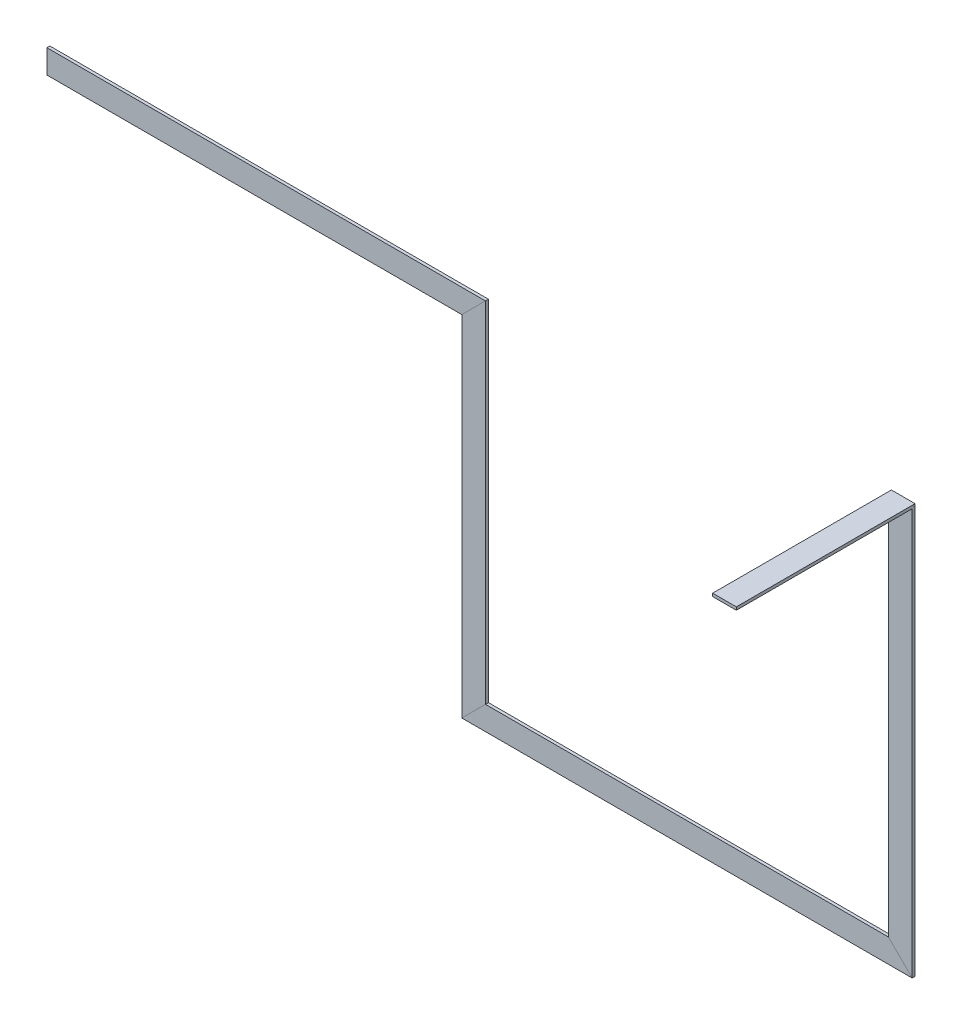
ISO-10303-21;
HEADER;
FILE_DESCRIPTION(('STEP AP214'),'2;1');
FILE_NAME('part.step','',(''),(''),'','','');
FILE_SCHEMA(('AUTOMOTIVE_DESIGN { 1 0 10303 214 1 1 1 1 }'));
ENDSEC;
DATA;
#1=APPLICATION_CONTEXT('core data for automotive mechanical design processes');
#2=APPLICATION_PROTOCOL_DEFINITION('international standard','automotive_design',2000,#1);
#3=PRODUCT_CONTEXT('',#1,'mechanical');
#4=PRODUCT('Part','Part','',(#3));
#5=PRODUCT_RELATED_PRODUCT_CATEGORY('part','',(#4));
#6=PRODUCT_DEFINITION_FORMATION('','',#4);
#7=PRODUCT_DEFINITION_CONTEXT('part definition',#1,'design');
#8=PRODUCT_DEFINITION('design','',#6,#7);
#9=PRODUCT_DEFINITION_SHAPE('','',#8);
#10=(LENGTH_UNIT() NAMED_UNIT(*) SI_UNIT(.MILLI.,.METRE.));
#11=(NAMED_UNIT(*) PLANE_ANGLE_UNIT() SI_UNIT($,.RADIAN.));
#12=(NAMED_UNIT(*) SI_UNIT($,.STERADIAN.) SOLID_ANGLE_UNIT());
#13=UNCERTAINTY_MEASURE_WITH_UNIT(LENGTH_MEASURE(1.E-05),#10,'distance_accuracy_value','');
#14=(GEOMETRIC_REPRESENTATION_CONTEXT(3) GLOBAL_UNCERTAINTY_ASSIGNED_CONTEXT((#13)) GLOBAL_UNIT_ASSIGNED_CONTEXT((#10,
#11,#12)) REPRESENTATION_CONTEXT('',''));
#15=CARTESIAN_POINT('',(0.,0.,0.));
#16=DIRECTION('',(0.,0.,1.));
#17=DIRECTION('',(1.,0.,0.));
#18=AXIS2_PLACEMENT_3D('',#15,#16,#17);
#19=CARTESIAN_POINT('',(841.621901722891,370.88196815617,38.2844706309671));
#20=DIRECTION('',(0.,0.,1.));
#21=DIRECTION('',(1.,0.,0.));
#22=AXIS2_PLACEMENT_3D('',#19,#20,#21);
#23=PLANE('',#22);
#24=DIRECTION('',(0.,-1.,0.));
#25=VECTOR('',#24,1.);
#26=CARTESIAN_POINT('',(892.421901722891,370.88196815617,38.2844706309671));
#27=LINE('',#26,#25);
#28=CARTESIAN_POINT('',(892.421901722891,364.11446815617,38.2844706309671));
#29=VERTEX_POINT('',#28);
#30=CARTESIAN_POINT('',(892.421901722891,-507.31053184383,38.2844706309671));
#31=VERTEX_POINT('',#30);
#32=EDGE_CURVE('E182',#29,#31,#27,.T.);
#33=ORIENTED_EDGE('',*,*,#32,.F.);
#34=DIRECTION('',(1.,0.,0.));
#35=VECTOR('',#34,1.);
#36=CARTESIAN_POINT('',(841.621901722891,364.11446815617,38.2844706309671));
#37=LINE('',#36,#35);
#38=CARTESIAN_POINT('',(841.621901722891,364.11446815617,38.2844706309671));
#39=VERTEX_POINT('',#38);
#40=EDGE_CURVE('E221',#39,#29,#37,.T.);
#41=ORIENTED_EDGE('',*,*,#40,.F.);
#42=DIRECTION('',(0.,-1.,0.));
#43=VECTOR('',#42,1.);
#44=CARTESIAN_POINT('',(841.621901722891,370.88196815617,38.2844706309671));
#45=LINE('',#44,#43);
#46=CARTESIAN_POINT('',(841.621901722891,-456.51053184383,38.2844706309671));
#47=VERTEX_POINT('',#46);
#48=EDGE_CURVE('E187',#39,#47,#45,.T.);
#49=ORIENTED_EDGE('',*,*,#48,.T.);
#50=DIRECTION('',(0.707106781186548,-0.707106781186548,0.));
#51=VECTOR('',#50,1.);
#52=CARTESIAN_POINT('',(427.925651722892,-42.81428184383,38.2844706309671));
#53=LINE('',#52,#51);
#54=EDGE_CURVE('E186',#47,#31,#53,.T.);
#55=ORIENTED_EDGE('',*,*,#54,.T.);
#56=EDGE_LOOP('',(#33,#41,#49,#55));
#57=FACE_BOUND('',#56,.T.);
#58=ADVANCED_FACE('F33',(#57),#23,.T.);
#59=CARTESIAN_POINT('',(-962.968098277108,1134.31136987906,-332.179997525203));
#60=DIRECTION('',(-1.,0.,0.));
#61=DIRECTION('',(0.,-1.,0.));
#62=AXIS2_PLACEMENT_3D('',#59,#60,#61);
#63=PLANE('',#62);
#64=DIRECTION('',(0.,0.,1.));
#65=VECTOR('',#64,1.);
#66=CARTESIAN_POINT('',(-962.968098277108,241.88946815617,38.2844706309671));
#67=LINE('',#66,#65);
#68=CARTESIAN_POINT('',(-962.968098277108,241.88946815617,31.9344706309671));
#69=VERTEX_POINT('',#68);
#70=CARTESIAN_POINT('',(-962.968098277108,241.88946815617,38.2844706309671));
#71=VERTEX_POINT('',#70);
#72=EDGE_CURVE('E108',#69,#71,#67,.T.);
#73=ORIENTED_EDGE('',*,*,#72,.T.);
#74=DIRECTION('',(0.,1.,0.));
#75=VECTOR('',#74,1.);
#76=CARTESIAN_POINT('',(-962.968098277108,292.68946815617,38.2844706309671));
#77=LINE('',#76,#75);
#78=CARTESIAN_POINT('',(-962.968098277108,292.68946815617,38.2844706309671));
#79=VERTEX_POINT('',#78);
#80=EDGE_CURVE('E106',#71,#79,#77,.T.);
#81=ORIENTED_EDGE('',*,*,#80,.T.);
#82=DIRECTION('',(0.,0.,-1.));
#83=VECTOR('',#82,1.);
#84=CARTESIAN_POINT('',(-962.968098277108,292.68946815617,38.2844706309671));
#85=LINE('',#84,#83);
#86=CARTESIAN_POINT('',(-962.968098277108,292.68946815617,31.9344706309671));
#87=VERTEX_POINT('',#86);
#88=EDGE_CURVE('E103',#79,#87,#85,.T.);
#89=ORIENTED_EDGE('',*,*,#88,.T.);
#90=DIRECTION('',(0.,-1.,0.));
#91=VECTOR('',#90,1.);
#92=CARTESIAN_POINT('',(-962.968098277108,292.68946815617,31.9344706309671));
#93=LINE('',#92,#91);
#94=EDGE_CURVE('E124',#87,#69,#93,.T.);
#95=ORIENTED_EDGE('',*,*,#94,.T.);
#96=EDGE_LOOP('',(#73,#81,#89,#95));
#97=FACE_BOUND('',#96,.T.);
#98=ADVANCED_FACE('F35',(#97),#63,.T.);
#99=CARTESIAN_POINT('',(-19.9380982771084,292.68946815617,38.2844706309671));
#100=DIRECTION('',(0.,1.,0.));
#101=DIRECTION('',(0.,0.,1.));
#102=AXIS2_PLACEMENT_3D('',#99,#100,#101);
#103=PLANE('',#102);
#104=DIRECTION('',(0.,0.,1.));
#105=VECTOR('',#104,1.);
#106=CARTESIAN_POINT('',(-22.5780982771083,292.68946815617,38.2844706309671));
#107=LINE('',#106,#105);
#108=CARTESIAN_POINT('',(-22.5780982771083,292.68946815617,31.9344706309671));
#109=VERTEX_POINT('',#108);
#110=CARTESIAN_POINT('',(-22.5780982771083,292.68946815617,38.2844706309671));
#111=VERTEX_POINT('',#110);
#112=EDGE_CURVE('E141',#109,#111,#107,.T.);
#113=ORIENTED_EDGE('',*,*,#112,.F.);
#114=DIRECTION('',(-1.,0.,0.));
#115=VECTOR('',#114,1.);
#116=CARTESIAN_POINT('',(-19.9380982771084,292.68946815617,31.9344706309671));
#117=LINE('',#116,#115);
#118=EDGE_CURVE('E122',#109,#87,#117,.T.);
#119=ORIENTED_EDGE('',*,*,#118,.T.);
#120=ORIENTED_EDGE('',*,*,#88,.F.);
#121=DIRECTION('',(-1.,0.,0.));
#122=VECTOR('',#121,1.);
#123=CARTESIAN_POINT('',(-19.9380982771084,292.68946815617,38.2844706309671));
#124=LINE('',#123,#122);
#125=EDGE_CURVE('E119',#111,#79,#124,.T.);
#126=ORIENTED_EDGE('',*,*,#125,.F.);
#127=EDGE_LOOP('',(#113,#119,#120,#126));
#128=FACE_BOUND('',#127,.T.);
#129=ADVANCED_FACE('F118',(#128),#103,.T.);
#130=CARTESIAN_POINT('',(-19.9380982771084,292.68946815617,31.9344706309671));
#131=DIRECTION('',(0.,0.,-1.));
#132=DIRECTION('',(-1.,0.,0.));
#133=AXIS2_PLACEMENT_3D('',#130,#131,#132);
#134=PLANE('',#133);
#135=DIRECTION('',(0.707106781186548,0.707106781186548,0.));
#136=VECTOR('',#135,1.);
#137=CARTESIAN_POINT('',(-423.898098277108,-108.63053184383,31.9344706309671));
#138=LINE('',#137,#136);
#139=CARTESIAN_POINT('',(-73.3780982771083,241.88946815617,31.9344706309671));
#140=VERTEX_POINT('',#139);
#141=EDGE_CURVE('E155',#140,#109,#138,.T.);
#142=ORIENTED_EDGE('',*,*,#141,.F.);
#143=DIRECTION('',(-1.,0.,0.));
#144=VECTOR('',#143,1.);
#145=CARTESIAN_POINT('',(-19.9380982771084,241.88946815617,31.9344706309671));
#146=LINE('',#145,#144);
#147=EDGE_CURVE('E133',#140,#69,#146,.T.);
#148=ORIENTED_EDGE('',*,*,#147,.T.);
#149=ORIENTED_EDGE('',*,*,#94,.F.);
#150=ORIENTED_EDGE('',*,*,#118,.F.);
#151=EDGE_LOOP('',(#142,#148,#149,#150));
#152=FACE_BOUND('',#151,.T.);
#153=ADVANCED_FACE('F363',(#152),#134,.T.);
#154=CARTESIAN_POINT('',(-19.9380982771084,241.88946815617,38.2844706309671));
#155=DIRECTION('',(0.,-1.,0.));
#156=DIRECTION('',(0.,0.,-1.));
#157=AXIS2_PLACEMENT_3D('',#154,#155,#156);
#158=PLANE('',#157);
#159=DIRECTION('',(0.,0.,-1.));
#160=VECTOR('',#159,1.);
#161=CARTESIAN_POINT('',(-73.3780982771083,241.88946815617,38.2844706309671));
#162=LINE('',#161,#160);
#163=CARTESIAN_POINT('',(-73.3780982771083,241.88946815617,38.2844706309671));
#164=VERTEX_POINT('',#163);
#165=EDGE_CURVE('E152',#164,#140,#162,.T.);
#166=ORIENTED_EDGE('',*,*,#165,.F.);
#167=DIRECTION('',(-1.,0.,0.));
#168=VECTOR('',#167,1.);
#169=CARTESIAN_POINT('',(-19.9380982771084,241.88946815617,38.2844706309671));
#170=LINE('',#169,#168);
#171=EDGE_CURVE('E123',#164,#71,#170,.T.);
#172=ORIENTED_EDGE('',*,*,#171,.T.);
#173=ORIENTED_EDGE('',*,*,#72,.F.);
#174=ORIENTED_EDGE('',*,*,#147,.F.);
#175=EDGE_LOOP('',(#166,#172,#173,#174));
#176=FACE_BOUND('',#175,.T.);
#177=ADVANCED_FACE('F366',(#176),#158,.T.);
#178=CARTESIAN_POINT('',(-19.9380982771084,292.68946815617,38.2844706309671));
#179=DIRECTION('',(0.,0.,1.));
#180=DIRECTION('',(1.,0.,0.));
#181=AXIS2_PLACEMENT_3D('',#178,#179,#180);
#182=PLANE('',#181);
#183=DIRECTION('',(-0.707106781186548,-0.707106781186548,0.));
#184=VECTOR('',#183,1.);
#185=CARTESIAN_POINT('',(-423.898098277108,-108.63053184383,38.2844706309671));
#186=LINE('',#185,#184);
#187=EDGE_CURVE('E128',#111,#164,#186,.T.);
#188=ORIENTED_EDGE('',*,*,#187,.F.);
#189=ORIENTED_EDGE('',*,*,#125,.T.);
#190=ORIENTED_EDGE('',*,*,#80,.F.);
#191=ORIENTED_EDGE('',*,*,#171,.F.);
#192=EDGE_LOOP('',(#188,#189,#190,#191));
#193=FACE_BOUND('',#192,.T.);
#194=ADVANCED_FACE('F126',(#193),#182,.T.);
#195=CARTESIAN_POINT('',(-22.5780982771083,-509.95053184383,38.2844706309671));
#196=DIRECTION('',(0.,0.,1.));
#197=DIRECTION('',(1.,0.,0.));
#198=AXIS2_PLACEMENT_3D('',#195,#196,#197);
#199=PLANE('',#198);
#200=DIRECTION('',(0.,1.,0.));
#201=VECTOR('',#200,1.);
#202=CARTESIAN_POINT('',(-22.5780982771083,-509.95053184383,38.2844706309671));
#203=LINE('',#202,#201);
#204=CARTESIAN_POINT('',(-22.5780982771083,-456.51053184383,38.2844706309671));
#205=VERTEX_POINT('',#204);
#206=EDGE_CURVE('E143',#205,#111,#203,.T.);
#207=ORIENTED_EDGE('',*,*,#206,.T.);
#208=ORIENTED_EDGE('',*,*,#187,.T.);
#209=DIRECTION('',(0.,1.,0.));
#210=VECTOR('',#209,1.);
#211=CARTESIAN_POINT('',(-73.3780982771083,-509.95053184383,38.2844706309671));
#212=LINE('',#211,#210);
#213=CARTESIAN_POINT('',(-73.3780982771083,-507.31053184383,38.2844706309671));
#214=VERTEX_POINT('',#213);
#215=EDGE_CURVE('E129',#214,#164,#212,.T.);
#216=ORIENTED_EDGE('',*,*,#215,.F.);
#217=DIRECTION('',(-0.707106781186548,-0.707106781186548,0.));
#218=VECTOR('',#217,1.);
#219=CARTESIAN_POINT('',(436.241901722892,2.30946815616995,38.2844706309671));
#220=LINE('',#219,#218);
#221=EDGE_CURVE('E162',#205,#214,#220,.T.);
#222=ORIENTED_EDGE('',*,*,#221,.F.);
#223=EDGE_LOOP('',(#207,#208,#216,#222));
#224=FACE_BOUND('',#223,.T.);
#225=ADVANCED_FACE('F277',(#224),#199,.T.);
#226=CARTESIAN_POINT('',(-73.3780982771083,-509.95053184383,38.2844706309671));
#227=DIRECTION('',(-1.,0.,0.));
#228=DIRECTION('',(0.,0.,1.));
#229=AXIS2_PLACEMENT_3D('',#226,#227,#228);
#230=PLANE('',#229);
#231=ORIENTED_EDGE('',*,*,#215,.T.);
#232=ORIENTED_EDGE('',*,*,#165,.T.);
#233=DIRECTION('',(0.,1.,0.));
#234=VECTOR('',#233,1.);
#235=CARTESIAN_POINT('',(-73.3780982771083,-509.95053184383,31.9344706309671));
#236=LINE('',#235,#234);
#237=CARTESIAN_POINT('',(-73.3780982771082,-507.31053184383,31.9344706309671));
#238=VERTEX_POINT('',#237);
#239=EDGE_CURVE('E131',#238,#140,#236,.T.);
#240=ORIENTED_EDGE('',*,*,#239,.F.);
#241=DIRECTION('',(0.,0.,-1.));
#242=VECTOR('',#241,1.);
#243=CARTESIAN_POINT('',(-73.3780982771083,-507.31053184383,38.2844706309671));
#244=LINE('',#243,#242);
#245=EDGE_CURVE('E176',#214,#238,#244,.T.);
#246=ORIENTED_EDGE('',*,*,#245,.F.);
#247=EDGE_LOOP('',(#231,#232,#240,#246));
#248=FACE_BOUND('',#247,.T.);
#249=ADVANCED_FACE('F275',(#248),#230,.T.);
#250=CARTESIAN_POINT('',(-22.5780982771083,-509.95053184383,31.9344706309671));
#251=DIRECTION('',(0.,0.,-1.));
#252=DIRECTION('',(-1.,0.,0.));
#253=AXIS2_PLACEMENT_3D('',#250,#251,#252);
#254=PLANE('',#253);
#255=ORIENTED_EDGE('',*,*,#239,.T.);
#256=ORIENTED_EDGE('',*,*,#141,.T.);
#257=DIRECTION('',(0.,1.,0.));
#258=VECTOR('',#257,1.);
#259=CARTESIAN_POINT('',(-22.5780982771083,-509.95053184383,31.9344706309671));
#260=LINE('',#259,#258);
#261=CARTESIAN_POINT('',(-22.5780982771083,-456.51053184383,31.9344706309671));
#262=VERTEX_POINT('',#261);
#263=EDGE_CURVE('E146',#262,#109,#260,.T.);
#264=ORIENTED_EDGE('',*,*,#263,.F.);
#265=DIRECTION('',(0.707106781186548,0.707106781186548,0.));
#266=VECTOR('',#265,1.);
#267=CARTESIAN_POINT('',(436.241901722892,2.30946815616995,31.9344706309671));
#268=LINE('',#267,#266);
#269=EDGE_CURVE('E179',#238,#262,#268,.T.);
#270=ORIENTED_EDGE('',*,*,#269,.F.);
#271=EDGE_LOOP('',(#255,#256,#264,#270));
#272=FACE_BOUND('',#271,.T.);
#273=ADVANCED_FACE('F352',(#272),#254,.T.);
#274=CARTESIAN_POINT('',(-22.5780982771083,-509.95053184383,38.2844706309671));
#275=DIRECTION('',(1.,0.,0.));
#276=DIRECTION('',(0.,0.,-1.));
#277=AXIS2_PLACEMENT_3D('',#274,#275,#276);
#278=PLANE('',#277);
#279=ORIENTED_EDGE('',*,*,#263,.T.);
#280=ORIENTED_EDGE('',*,*,#112,.T.);
#281=ORIENTED_EDGE('',*,*,#206,.F.);
#282=DIRECTION('',(0.,0.,1.));
#283=VECTOR('',#282,1.);
#284=CARTESIAN_POINT('',(-22.5780982771083,-456.51053184383,38.2844706309671));
#285=LINE('',#284,#283);
#286=EDGE_CURVE('E159',#262,#205,#285,.T.);
#287=ORIENTED_EDGE('',*,*,#286,.F.);
#288=EDGE_LOOP('',(#279,#280,#281,#287));
#289=FACE_BOUND('',#288,.T.);
#290=ADVANCED_FACE('F349',(#289),#278,.T.);
#291=CARTESIAN_POINT('',(895.061901722891,-456.51053184383,38.2844706309671));
#292=DIRECTION('',(0.,0.,1.));
#293=DIRECTION('',(1.,0.,0.));
#294=AXIS2_PLACEMENT_3D('',#291,#292,#293);
#295=PLANE('',#294);
#296=DIRECTION('',(-1.,0.,0.));
#297=VECTOR('',#296,1.);
#298=CARTESIAN_POINT('',(895.061901722891,-456.51053184383,38.2844706309671));
#299=LINE('',#298,#297);
#300=EDGE_CURVE('E163',#47,#205,#299,.T.);
#301=ORIENTED_EDGE('',*,*,#300,.T.);
#302=ORIENTED_EDGE('',*,*,#221,.T.);
#303=DIRECTION('',(-1.,0.,0.));
#304=VECTOR('',#303,1.);
#305=CARTESIAN_POINT('',(895.061901722891,-507.31053184383,38.2844706309671));
#306=LINE('',#305,#304);
#307=EDGE_CURVE('E158',#31,#214,#306,.T.);
#308=ORIENTED_EDGE('',*,*,#307,.F.);
#309=ORIENTED_EDGE('',*,*,#54,.F.);
#310=EDGE_LOOP('',(#301,#302,#308,#309));
#311=FACE_BOUND('',#310,.T.);
#312=ADVANCED_FACE('F280',(#311),#295,.T.);
#313=CARTESIAN_POINT('',(895.061901722891,-507.31053184383,38.2844706309671));
#314=DIRECTION('',(0.,-1.,0.));
#315=DIRECTION('',(0.,0.,-1.));
#316=AXIS2_PLACEMENT_3D('',#313,#314,#315);
#317=PLANE('',#316);
#318=ORIENTED_EDGE('',*,*,#307,.T.);
#319=ORIENTED_EDGE('',*,*,#245,.T.);
#320=DIRECTION('',(-1.,0.,0.));
#321=VECTOR('',#320,1.);
#322=CARTESIAN_POINT('',(895.061901722891,-507.31053184383,31.9344706309671));
#323=LINE('',#322,#321);
#324=CARTESIAN_POINT('',(892.421901722891,-507.31053184383,31.9344706309671));
#325=VERTEX_POINT('',#324);
#326=EDGE_CURVE('E169',#325,#238,#323,.T.);
#327=ORIENTED_EDGE('',*,*,#326,.F.);
#328=DIRECTION('',(0.,0.,-1.));
#329=VECTOR('',#328,1.);
#330=CARTESIAN_POINT('',(892.421901722891,-507.31053184383,38.2844706309671));
#331=LINE('',#330,#329);
#332=EDGE_CURVE('E196',#31,#325,#331,.T.);
#333=ORIENTED_EDGE('',*,*,#332,.F.);
#334=EDGE_LOOP('',(#318,#319,#327,#333));
#335=FACE_BOUND('',#334,.T.);
#336=ADVANCED_FACE('F270',(#335),#317,.T.);
#337=CARTESIAN_POINT('',(895.061901722891,-456.51053184383,31.9344706309671));
#338=DIRECTION('',(0.,0.,-1.));
#339=DIRECTION('',(-1.,0.,0.));
#340=AXIS2_PLACEMENT_3D('',#337,#338,#339);
#341=PLANE('',#340);
#342=ORIENTED_EDGE('',*,*,#326,.T.);
#343=ORIENTED_EDGE('',*,*,#269,.T.);
#344=DIRECTION('',(-1.,0.,0.));
#345=VECTOR('',#344,1.);
#346=CARTESIAN_POINT('',(895.061901722891,-456.51053184383,31.9344706309671));
#347=LINE('',#346,#345);
#348=CARTESIAN_POINT('',(841.621901722891,-456.51053184383,31.9344706309671));
#349=VERTEX_POINT('',#348);
#350=EDGE_CURVE('E166',#349,#262,#347,.T.);
#351=ORIENTED_EDGE('',*,*,#350,.F.);
#352=DIRECTION('',(-0.707106781186548,0.707106781186548,0.));
#353=VECTOR('',#352,1.);
#354=CARTESIAN_POINT('',(427.925651722892,-42.81428184383,31.9344706309671));
#355=LINE('',#354,#353);
#356=EDGE_CURVE('E199',#325,#349,#355,.T.);
#357=ORIENTED_EDGE('',*,*,#356,.F.);
#358=EDGE_LOOP('',(#342,#343,#351,#357));
#359=FACE_BOUND('',#358,.T.);
#360=ADVANCED_FACE('F268',(#359),#341,.T.);
#361=CARTESIAN_POINT('',(895.061901722891,-456.51053184383,38.2844706309671));
#362=DIRECTION('',(0.,1.,0.));
#363=DIRECTION('',(0.,0.,1.));
#364=AXIS2_PLACEMENT_3D('',#361,#362,#363);
#365=PLANE('',#364);
#366=ORIENTED_EDGE('',*,*,#350,.T.);
#367=ORIENTED_EDGE('',*,*,#286,.T.);
#368=ORIENTED_EDGE('',*,*,#300,.F.);
#369=DIRECTION('',(0.,0.,1.));
#370=VECTOR('',#369,1.);
#371=CARTESIAN_POINT('',(841.621901722891,-456.51053184383,38.2844706309671));
#372=LINE('',#371,#370);
#373=EDGE_CURVE('E183',#349,#47,#372,.T.);
#374=ORIENTED_EDGE('',*,*,#373,.F.);
#375=EDGE_LOOP('',(#366,#367,#368,#374));
#376=FACE_BOUND('',#375,.T.);
#377=ADVANCED_FACE('F285',(#376),#365,.T.);
#378=CARTESIAN_POINT('',(892.421901722891,370.88196815617,38.2844706309671));
#379=DIRECTION('',(1.,0.,0.));
#380=DIRECTION('',(0.,0.,-1.));
#381=AXIS2_PLACEMENT_3D('',#378,#379,#380);
#382=PLANE('',#381);
#383=DIRECTION('',(0.,-0.707106781186548,-0.707106781186548));
#384=VECTOR('',#383,1.);
#385=CARTESIAN_POINT('',(892.421901722891,331.322232840686,-0.857764684516447));
#386=LINE('',#385,#384);
#387=CARTESIAN_POINT('',(892.421901722891,370.46446815617,38.2844706309671));
#388=VERTEX_POINT('',#387);
#389=CARTESIAN_POINT('',(892.421901722891,364.11446815617,31.9344706309671));
#390=VERTEX_POINT('',#389);
#391=EDGE_CURVE('E42',#388,#390,#386,.T.);
#392=ORIENTED_EDGE('',*,*,#391,.F.);
#393=DIRECTION('',(0.,0.,-1.));
#394=VECTOR('',#393,1.);
#395=CARTESIAN_POINT('',(892.421901722891,370.46446815617,415.284470630967));
#396=LINE('',#395,#394);
#397=CARTESIAN_POINT('',(892.421901722891,370.46446815617,415.284470630967));
#398=VERTEX_POINT('',#397);
#399=EDGE_CURVE('E215',#398,#388,#396,.T.);
#400=ORIENTED_EDGE('',*,*,#399,.F.);
#401=DIRECTION('',(0.,1.,0.));
#402=VECTOR('',#401,1.);
#403=CARTESIAN_POINT('',(892.421901722891,364.11446815617,415.284470630967));
#404=LINE('',#403,#402);
#405=CARTESIAN_POINT('',(892.421901722891,364.11446815617,415.284470630967));
#406=VERTEX_POINT('',#405);
#407=EDGE_CURVE('E228',#406,#398,#404,.T.);
#408=ORIENTED_EDGE('',*,*,#407,.F.);
#409=DIRECTION('',(0.,0.,-1.));
#410=VECTOR('',#409,1.);
#411=CARTESIAN_POINT('',(892.421901722891,364.11446815617,415.284470630967));
#412=LINE('',#411,#410);
#413=EDGE_CURVE('E212',#406,#29,#412,.T.);
#414=ORIENTED_EDGE('',*,*,#413,.T.);
#415=ORIENTED_EDGE('',*,*,#32,.T.);
#416=ORIENTED_EDGE('',*,*,#332,.T.);
#417=DIRECTION('',(0.,-1.,0.));
#418=VECTOR('',#417,1.);
#419=CARTESIAN_POINT('',(892.421901722891,370.88196815617,31.9344706309671));
#420=LINE('',#419,#418);
#421=EDGE_CURVE('E191',#390,#325,#420,.T.);
#422=ORIENTED_EDGE('',*,*,#421,.F.);
#423=EDGE_LOOP('',(#392,#400,#408,#414,#415,#416,#422));
#424=FACE_BOUND('',#423,.T.);
#425=ADVANCED_FACE('F260',(#424),#382,.T.);
#426=CARTESIAN_POINT('',(841.621901722891,370.88196815617,31.9344706309671));
#427=DIRECTION('',(0.,0.,-1.));
#428=DIRECTION('',(-1.,0.,0.));
#429=AXIS2_PLACEMENT_3D('',#426,#427,#428);
#430=PLANE('',#429);
#431=ORIENTED_EDGE('',*,*,#421,.T.);
#432=ORIENTED_EDGE('',*,*,#356,.T.);
#433=DIRECTION('',(0.,-1.,0.));
#434=VECTOR('',#433,1.);
#435=CARTESIAN_POINT('',(841.621901722891,370.88196815617,31.9344706309671));
#436=LINE('',#435,#434);
#437=CARTESIAN_POINT('',(841.621901722891,364.11446815617,31.9344706309671));
#438=VERTEX_POINT('',#437);
#439=EDGE_CURVE('E189',#438,#349,#436,.T.);
#440=ORIENTED_EDGE('',*,*,#439,.F.);
#441=DIRECTION('',(0.,1.,0.));
#442=VECTOR('',#441,1.);
#443=CARTESIAN_POINT('',(841.621901722891,370.46446815617,31.9344706309671));
#444=LINE('',#443,#442);
#445=CARTESIAN_POINT('',(841.621901722891,370.46446815617,31.9344706309671));
#446=VERTEX_POINT('',#445);
#447=EDGE_CURVE('E11',#438,#446,#444,.T.);
#448=ORIENTED_EDGE('',*,*,#447,.T.);
#449=DIRECTION('',(1.,0.,0.));
#450=VECTOR('',#449,1.);
#451=CARTESIAN_POINT('',(841.621901722891,370.46446815617,31.9344706309671));
#452=LINE('',#451,#450);
#453=CARTESIAN_POINT('',(892.421901722891,370.46446815617,31.9344706309671));
#454=VERTEX_POINT('',#453);
#455=EDGE_CURVE('E237',#446,#454,#452,.T.);
#456=ORIENTED_EDGE('',*,*,#455,.T.);
#457=DIRECTION('',(0.,1.,0.));
#458=VECTOR('',#457,1.);
#459=CARTESIAN_POINT('',(892.421901722891,360.46446815617,31.9344706309671));
#460=LINE('',#459,#458);
#461=EDGE_CURVE('E225',#390,#454,#460,.T.);
#462=ORIENTED_EDGE('',*,*,#461,.F.);
#463=EDGE_LOOP('',(#431,#432,#440,#448,#456,#462));
#464=FACE_BOUND('',#463,.T.);
#465=ADVANCED_FACE('F243',(#464),#430,.T.);
#466=CARTESIAN_POINT('',(841.621901722891,370.88196815617,38.2844706309671));
#467=DIRECTION('',(-1.,0.,0.));
#468=DIRECTION('',(0.,0.,1.));
#469=AXIS2_PLACEMENT_3D('',#466,#467,#468);
#470=PLANE('',#469);
#471=ORIENTED_EDGE('',*,*,#439,.T.);
#472=ORIENTED_EDGE('',*,*,#373,.T.);
#473=ORIENTED_EDGE('',*,*,#48,.F.);
#474=DIRECTION('',(0.,0.,-1.));
#475=VECTOR('',#474,1.);
#476=CARTESIAN_POINT('',(841.621901722891,364.11446815617,415.284470630967));
#477=LINE('',#476,#475);
#478=CARTESIAN_POINT('',(841.621901722891,364.11446815617,415.284470630967));
#479=VERTEX_POINT('',#478);
#480=EDGE_CURVE('E113',#479,#39,#477,.T.);
#481=ORIENTED_EDGE('',*,*,#480,.F.);
#482=DIRECTION('',(0.,-1.,0.));
#483=VECTOR('',#482,1.);
#484=CARTESIAN_POINT('',(841.621901722891,370.46446815617,415.284470630967));
#485=LINE('',#484,#483);
#486=CARTESIAN_POINT('',(841.621901722891,370.46446815617,415.284470630967));
#487=VERTEX_POINT('',#486);
#488=EDGE_CURVE('E224',#487,#479,#485,.T.);
#489=ORIENTED_EDGE('',*,*,#488,.F.);
#490=DIRECTION('',(0.,0.,-1.));
#491=VECTOR('',#490,1.);
#492=CARTESIAN_POINT('',(841.621901722891,370.46446815617,415.284470630967));
#493=LINE('',#492,#491);
#494=CARTESIAN_POINT('',(841.621901722891,370.46446815617,38.2844706309671));
#495=VERTEX_POINT('',#494);
#496=EDGE_CURVE('E217',#487,#495,#493,.T.);
#497=ORIENTED_EDGE('',*,*,#496,.T.);
#498=DIRECTION('',(0.,0.707106781186548,0.707106781186548));
#499=VECTOR('',#498,1.);
#500=CARTESIAN_POINT('',(841.621901722891,331.322232840686,-0.857764684516447));
#501=LINE('',#500,#499);
#502=EDGE_CURVE('E203',#438,#495,#501,.T.);
#503=ORIENTED_EDGE('',*,*,#502,.F.);
#504=EDGE_LOOP('',(#471,#472,#473,#481,#489,#497,#503));
#505=FACE_BOUND('',#504,.T.);
#506=ADVANCED_FACE('F288',(#505),#470,.T.);
#507=CARTESIAN_POINT('',(841.621901722891,370.46446815617,-40.));
#508=DIRECTION('',(0.,1.,0.));
#509=DIRECTION('',(0.,0.,1.));
#510=AXIS2_PLACEMENT_3D('',#507,#508,#509);
#511=PLANE('',#510);
#512=ORIENTED_EDGE('',*,*,#455,.F.);
#513=DIRECTION('',(0.,0.,1.));
#514=VECTOR('',#513,1.);
#515=CARTESIAN_POINT('',(841.621901722891,370.46446815617,-40.));
#516=LINE('',#515,#514);
#517=EDGE_CURVE('E202',#446,#495,#516,.T.);
#518=ORIENTED_EDGE('',*,*,#517,.T.);
#519=ORIENTED_EDGE('',*,*,#496,.F.);
#520=DIRECTION('',(-1.,0.,0.));
#521=VECTOR('',#520,1.);
#522=CARTESIAN_POINT('',(892.421901722891,370.46446815617,415.284470630967));
#523=LINE('',#522,#521);
#524=EDGE_CURVE('E220',#398,#487,#523,.T.);
#525=ORIENTED_EDGE('',*,*,#524,.F.);
#526=ORIENTED_EDGE('',*,*,#399,.T.);
#527=DIRECTION('',(0.,0.,1.));
#528=VECTOR('',#527,1.);
#529=CARTESIAN_POINT('',(892.421901722891,370.46446815617,-40.));
#530=LINE('',#529,#528);
#531=EDGE_CURVE('E50',#454,#388,#530,.T.);
#532=ORIENTED_EDGE('',*,*,#531,.F.);
#533=EDGE_LOOP('',(#512,#518,#519,#525,#526,#532));
#534=FACE_BOUND('',#533,.T.);
#535=ADVANCED_FACE('F253',(#534),#511,.T.);
#536=CARTESIAN_POINT('',(892.421901722891,370.46446815617,-40.));
#537=DIRECTION('',(1.,0.,0.));
#538=DIRECTION('',(0.,0.,-1.));
#539=AXIS2_PLACEMENT_3D('',#536,#537,#538);
#540=PLANE('',#539);
#541=ORIENTED_EDGE('',*,*,#461,.T.);
#542=ORIENTED_EDGE('',*,*,#531,.T.);
#543=ORIENTED_EDGE('',*,*,#391,.T.);
#544=EDGE_LOOP('',(#541,#542,#543));
#545=FACE_BOUND('',#544,.T.);
#546=ADVANCED_FACE('F251',(#545),#540,.T.);
#547=CARTESIAN_POINT('',(841.621901722891,370.46446815617,-40.));
#548=DIRECTION('',(-1.,0.,0.));
#549=DIRECTION('',(0.,0.,1.));
#550=AXIS2_PLACEMENT_3D('',#547,#548,#549);
#551=PLANE('',#550);
#552=ORIENTED_EDGE('',*,*,#447,.F.);
#553=ORIENTED_EDGE('',*,*,#502,.T.);
#554=ORIENTED_EDGE('',*,*,#517,.F.);
#555=EDGE_LOOP('',(#552,#553,#554));
#556=FACE_BOUND('',#555,.T.);
#557=ADVANCED_FACE('F294',(#556),#551,.T.);
#558=CARTESIAN_POINT('',(841.621901722891,364.11446815617,415.284470630967));
#559=DIRECTION('',(0.,1.,0.));
#560=DIRECTION('',(0.,0.,1.));
#561=AXIS2_PLACEMENT_3D('',#558,#559,#560);
#562=PLANE('',#561);
#563=ORIENTED_EDGE('',*,*,#40,.T.);
#564=ORIENTED_EDGE('',*,*,#413,.F.);
#565=DIRECTION('',(1.,0.,0.));
#566=VECTOR('',#565,1.);
#567=CARTESIAN_POINT('',(841.621901722891,364.11446815617,415.284470630967));
#568=LINE('',#567,#566);
#569=EDGE_CURVE('E231',#479,#406,#568,.T.);
#570=ORIENTED_EDGE('',*,*,#569,.F.);
#571=ORIENTED_EDGE('',*,*,#480,.T.);
#572=EDGE_LOOP('',(#563,#564,#570,#571));
#573=FACE_BOUND('',#572,.T.);
#574=ADVANCED_FACE('F310',(#573),#562,.F.);
#575=CARTESIAN_POINT('',(0.,0.,415.284470630967));
#576=DIRECTION('',(0.,0.,1.));
#577=DIRECTION('',(1.,0.,0.));
#578=AXIS2_PLACEMENT_3D('',#575,#576,#577);
#579=PLANE('',#578);
#580=ORIENTED_EDGE('',*,*,#488,.T.);
#581=ORIENTED_EDGE('',*,*,#569,.T.);
#582=ORIENTED_EDGE('',*,*,#407,.T.);
#583=ORIENTED_EDGE('',*,*,#524,.T.);
#584=EDGE_LOOP('',(#580,#581,#582,#583));
#585=FACE_BOUND('',#584,.T.);
#586=ADVANCED_FACE('F308',(#585),#579,.T.);
#587=CLOSED_SHELL('',(#58,#98,#129,#153,#177,#194,#225,#249,#273,#290,#312,#336,#360,#377,#425,
#465,#506,#535,#546,#557,#574,#586));
#588=MANIFOLD_SOLID_BREP('B2',#587);
#589=ADVANCED_BREP_SHAPE_REPRESENTATION('',(#18,#588),#14);
#590=SHAPE_DEFINITION_REPRESENTATION(#9,#589);
ENDSEC;
END-ISO-10303-21;
